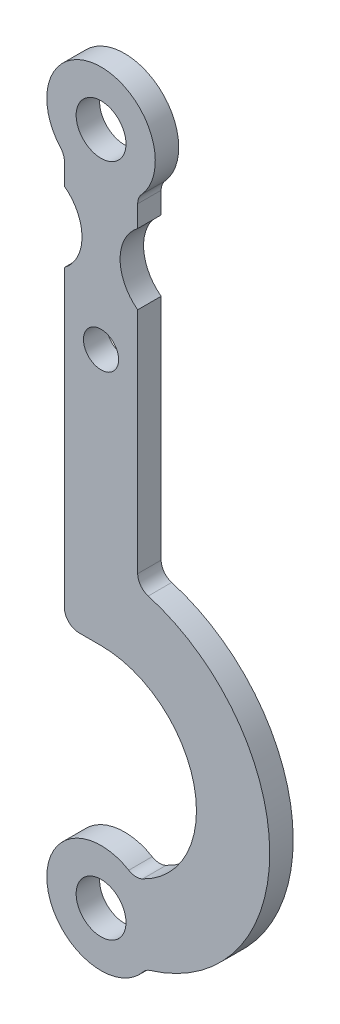
ISO-10303-21;
HEADER;
FILE_DESCRIPTION(('STEP AP214'),'2;1');
FILE_NAME('part.step','',(''),(''),'','','');
FILE_SCHEMA(('AUTOMOTIVE_DESIGN { 1 0 10303 214 1 1 1 1 }'));
ENDSEC;
DATA;
#1=APPLICATION_CONTEXT('core data for automotive mechanical design processes');
#2=APPLICATION_PROTOCOL_DEFINITION('international standard','automotive_design',2000,#1);
#3=PRODUCT_CONTEXT('',#1,'mechanical');
#4=PRODUCT('Part','Part','',(#3));
#5=PRODUCT_RELATED_PRODUCT_CATEGORY('part','',(#4));
#6=PRODUCT_DEFINITION_FORMATION('','',#4);
#7=PRODUCT_DEFINITION_CONTEXT('part definition',#1,'design');
#8=PRODUCT_DEFINITION('design','',#6,#7);
#9=PRODUCT_DEFINITION_SHAPE('','',#8);
#10=(LENGTH_UNIT() NAMED_UNIT(*) SI_UNIT(.MILLI.,.METRE.));
#11=(NAMED_UNIT(*) PLANE_ANGLE_UNIT() SI_UNIT($,.RADIAN.));
#12=(NAMED_UNIT(*) SI_UNIT($,.STERADIAN.) SOLID_ANGLE_UNIT());
#13=UNCERTAINTY_MEASURE_WITH_UNIT(LENGTH_MEASURE(1.E-05),#10,'distance_accuracy_value','');
#14=(GEOMETRIC_REPRESENTATION_CONTEXT(3) GLOBAL_UNCERTAINTY_ASSIGNED_CONTEXT((#13)) GLOBAL_UNIT_ASSIGNED_CONTEXT((#10,
#11,#12)) REPRESENTATION_CONTEXT('',''));
#15=CARTESIAN_POINT('',(0.,0.,0.));
#16=DIRECTION('',(0.,0.,1.));
#17=DIRECTION('',(1.,0.,0.));
#18=AXIS2_PLACEMENT_3D('',#15,#16,#17);
#19=CARTESIAN_POINT('',(0.,-230.,8.));
#20=DIRECTION('',(0.,0.,-1.));
#21=DIRECTION('',(-1.,0.,0.));
#22=AXIS2_PLACEMENT_3D('',#19,#20,#21);
#23=CYLINDRICAL_SURFACE('',#22,18.5);
#24=CARTESIAN_POINT('',(0.,-230.,0.));
#25=DIRECTION('',(0.,0.,1.));
#26=DIRECTION('',(1.,0.,0.));
#27=AXIS2_PLACEMENT_3D('',#24,#25,#26);
#28=CIRCLE('',#27,18.5);
#29=CARTESIAN_POINT('',(9.44463891587366,-214.092492472145,0.));
#30=VERTEX_POINT('',#29);
#31=CARTESIAN_POINT('',(14.3530284553606,-241.672213764304,0.));
#32=VERTEX_POINT('',#31);
#33=EDGE_CURVE('E224',#30,#32,#28,.T.);
#34=ORIENTED_EDGE('',*,*,#33,.T.);
#35=DIRECTION('',(0.,0.,-1.));
#36=VECTOR('',#35,1.);
#37=CARTESIAN_POINT('',(14.3530284553606,-241.672213764304,8.));
#38=LINE('',#37,#36);
#39=CARTESIAN_POINT('',(14.3530284553606,-241.672213764304,8.));
#40=VERTEX_POINT('',#39);
#41=EDGE_CURVE('E265',#32,#40,#38,.F.);
#42=ORIENTED_EDGE('',*,*,#41,.T.);
#43=CARTESIAN_POINT('',(0.,-230.,8.));
#44=DIRECTION('',(0.,0.,1.));
#45=DIRECTION('',(1.,0.,0.));
#46=AXIS2_PLACEMENT_3D('',#43,#44,#45);
#47=CIRCLE('',#46,18.5);
#48=CARTESIAN_POINT('',(9.44463891587366,-214.092492472145,8.));
#49=VERTEX_POINT('',#48);
#50=EDGE_CURVE('E391',#49,#40,#47,.T.);
#51=ORIENTED_EDGE('',*,*,#50,.F.);
#52=DIRECTION('',(0.,0.,-1.));
#53=VECTOR('',#52,1.);
#54=CARTESIAN_POINT('',(9.44463891587366,-214.092492472145,8.));
#55=LINE('',#54,#53);
#56=EDGE_CURVE('E262',#49,#30,#55,.T.);
#57=ORIENTED_EDGE('',*,*,#56,.T.);
#58=EDGE_LOOP('',(#34,#42,#51,#57));
#59=FACE_BOUND('',#58,.T.);
#60=ADVANCED_FACE('F47',(#59),#23,.T.);
#61=CARTESIAN_POINT('',(0.,-185.,8.));
#62=DIRECTION('',(0.,0.,-1.));
#63=DIRECTION('',(-1.,0.,0.));
#64=AXIS2_PLACEMENT_3D('',#61,#62,#63);
#65=CYLINDRICAL_SURFACE('',#64,57.5433285968466);
#66=CARTESIAN_POINT('',(0.,-185.,8.));
#67=DIRECTION('',(0.,0.,1.));
#68=DIRECTION('',(1.,0.,0.));
#69=AXIS2_PLACEMENT_3D('',#66,#67,#68);
#70=CIRCLE('',#69,57.5433285968466);
#71=CARTESIAN_POINT('',(16.7746577780857,-240.044032577862,8.));
#72=VERTEX_POINT('',#71);
#73=CARTESIAN_POINT('',(16.1009698881871,-129.755150152577,8.));
#74=VERTEX_POINT('',#73);
#75=EDGE_CURVE('E189',#72,#74,#70,.T.);
#76=ORIENTED_EDGE('',*,*,#75,.F.);
#77=DIRECTION('',(0.,0.,-1.));
#78=VECTOR('',#77,1.);
#79=CARTESIAN_POINT('',(16.7746577780857,-240.044032577862,8.));
#80=LINE('',#79,#78);
#81=CARTESIAN_POINT('',(16.7746577780857,-240.044032577862,0.));
#82=VERTEX_POINT('',#81);
#83=EDGE_CURVE('E259',#72,#82,#80,.T.);
#84=ORIENTED_EDGE('',*,*,#83,.T.);
#85=CARTESIAN_POINT('',(0.,-185.,0.));
#86=DIRECTION('',(0.,0.,1.));
#87=DIRECTION('',(1.,0.,0.));
#88=AXIS2_PLACEMENT_3D('',#85,#86,#87);
#89=CIRCLE('',#88,57.5433285968466);
#90=CARTESIAN_POINT('',(16.1009698881871,-129.755150152577,0.));
#91=VERTEX_POINT('',#90);
#92=EDGE_CURVE('E227',#82,#91,#89,.T.);
#93=ORIENTED_EDGE('',*,*,#92,.T.);
#94=DIRECTION('',(0.,0.,-1.));
#95=VECTOR('',#94,1.);
#96=CARTESIAN_POINT('',(16.1009698881871,-129.755150152577,8.));
#97=LINE('',#96,#95);
#98=EDGE_CURVE('E179',#91,#74,#97,.F.);
#99=ORIENTED_EDGE('',*,*,#98,.T.);
#100=EDGE_LOOP('',(#76,#84,#93,#99));
#101=FACE_BOUND('',#100,.T.);
#102=ADVANCED_FACE('F309',(#101),#65,.T.);
#103=CARTESIAN_POINT('',(12.5,0.,8.));
#104=DIRECTION('',(1.,0.,0.));
#105=DIRECTION('',(0.,1.,0.));
#106=AXIS2_PLACEMENT_3D('',#103,#104,#105);
#107=PLANE('',#106);
#108=DIRECTION('',(0.,-1.,0.));
#109=VECTOR('',#108,1.);
#110=CARTESIAN_POINT('',(12.5,0.,8.));
#111=LINE('',#110,#109);
#112=CARTESIAN_POINT('',(12.5,-47.,8.));
#113=VERTEX_POINT('',#112);
#114=CARTESIAN_POINT('',(12.5,-124.954867374839,8.));
#115=VERTEX_POINT('',#114);
#116=EDGE_CURVE('E171',#113,#115,#111,.T.);
#117=ORIENTED_EDGE('',*,*,#116,.T.);
#118=DIRECTION('',(0.,0.,-1.));
#119=VECTOR('',#118,1.);
#120=CARTESIAN_POINT('',(12.5,-124.954867374839,8.));
#121=LINE('',#120,#119);
#122=CARTESIAN_POINT('',(12.5,-124.954867374839,0.));
#123=VERTEX_POINT('',#122);
#124=EDGE_CURVE('E279',#115,#123,#121,.T.);
#125=ORIENTED_EDGE('',*,*,#124,.T.);
#126=DIRECTION('',(0.,-1.,0.));
#127=VECTOR('',#126,1.);
#128=CARTESIAN_POINT('',(12.5,0.,0.));
#129=LINE('',#128,#127);
#130=CARTESIAN_POINT('',(12.5,-47.,0.));
#131=VERTEX_POINT('',#130);
#132=EDGE_CURVE('E174',#131,#123,#129,.T.);
#133=ORIENTED_EDGE('',*,*,#132,.F.);
#134=DIRECTION('',(0.,0.,-1.));
#135=VECTOR('',#134,1.);
#136=CARTESIAN_POINT('',(12.5,-47.,8.));
#137=LINE('',#136,#135);
#138=EDGE_CURVE('E167',#113,#131,#137,.T.);
#139=ORIENTED_EDGE('',*,*,#138,.F.);
#140=EDGE_LOOP('',(#117,#125,#133,#139));
#141=FACE_BOUND('',#140,.T.);
#142=ADVANCED_FACE('F169',(#141),#107,.T.);
#143=CARTESIAN_POINT('',(21.5,-35.,8.));
#144=DIRECTION('',(0.,0.,-1.));
#145=DIRECTION('',(-1.,0.,0.));
#146=AXIS2_PLACEMENT_3D('',#143,#144,#145);
#147=CYLINDRICAL_SURFACE('',#146,15.);
#148=CARTESIAN_POINT('',(21.5,-35.,0.));
#149=DIRECTION('',(0.,0.,1.));
#150=DIRECTION('',(1.,0.,0.));
#151=AXIS2_PLACEMENT_3D('',#148,#149,#150);
#152=CIRCLE('',#151,15.);
#153=CARTESIAN_POINT('',(12.5,-23.,0.));
#154=VERTEX_POINT('',#153);
#155=EDGE_CURVE('E231',#154,#131,#152,.T.);
#156=ORIENTED_EDGE('',*,*,#155,.F.);
#157=DIRECTION('',(0.,0.,-1.));
#158=VECTOR('',#157,1.);
#159=CARTESIAN_POINT('',(12.5,-23.,8.));
#160=LINE('',#159,#158);
#161=CARTESIAN_POINT('',(12.5,-23.,8.));
#162=VERTEX_POINT('',#161);
#163=EDGE_CURVE('E180',#162,#154,#160,.T.);
#164=ORIENTED_EDGE('',*,*,#163,.F.);
#165=CARTESIAN_POINT('',(21.5,-35.,8.));
#166=DIRECTION('',(0.,0.,1.));
#167=DIRECTION('',(1.,0.,0.));
#168=AXIS2_PLACEMENT_3D('',#165,#166,#167);
#169=CIRCLE('',#168,15.);
#170=EDGE_CURVE('E186',#162,#113,#169,.T.);
#171=ORIENTED_EDGE('',*,*,#170,.T.);
#172=ORIENTED_EDGE('',*,*,#138,.T.);
#173=EDGE_LOOP('',(#156,#164,#171,#172));
#174=FACE_BOUND('',#173,.T.);
#175=ADVANCED_FACE('F192',(#174),#147,.F.);
#176=CARTESIAN_POINT('',(12.5,0.,8.));
#177=DIRECTION('',(1.,0.,0.));
#178=DIRECTION('',(0.,1.,0.));
#179=AXIS2_PLACEMENT_3D('',#176,#177,#178);
#180=PLANE('',#179);
#181=DIRECTION('',(0.,-1.,0.));
#182=VECTOR('',#181,1.);
#183=CARTESIAN_POINT('',(12.5,0.,0.));
#184=LINE('',#183,#182);
#185=CARTESIAN_POINT('',(12.5,-15.6843871413581,0.));
#186=VERTEX_POINT('',#185);
#187=EDGE_CURVE('E233',#186,#154,#184,.T.);
#188=ORIENTED_EDGE('',*,*,#187,.F.);
#189=DIRECTION('',(0.,0.,1.));
#190=VECTOR('',#189,1.);
#191=CARTESIAN_POINT('',(12.5,-15.6843871413581,8.));
#192=LINE('',#191,#190);
#193=CARTESIAN_POINT('',(12.5,-15.6843871413581,8.));
#194=VERTEX_POINT('',#193);
#195=EDGE_CURVE('E274',#186,#194,#192,.T.);
#196=ORIENTED_EDGE('',*,*,#195,.T.);
#197=DIRECTION('',(0.,-1.,0.));
#198=VECTOR('',#197,1.);
#199=CARTESIAN_POINT('',(12.5,0.,8.));
#200=LINE('',#199,#198);
#201=EDGE_CURVE('E194',#194,#162,#200,.T.);
#202=ORIENTED_EDGE('',*,*,#201,.T.);
#203=ORIENTED_EDGE('',*,*,#163,.T.);
#204=EDGE_LOOP('',(#188,#196,#202,#203));
#205=FACE_BOUND('',#204,.T.);
#206=ADVANCED_FACE('F434',(#205),#180,.T.);
#207=CARTESIAN_POINT('',(0.,0.,8.));
#208=DIRECTION('',(0.,0.,-1.));
#209=DIRECTION('',(-1.,0.,0.));
#210=AXIS2_PLACEMENT_3D('',#207,#208,#209);
#211=CYLINDRICAL_SURFACE('',#210,18.5);
#212=CARTESIAN_POINT('',(0.,0.,8.));
#213=DIRECTION('',(0.,0.,1.));
#214=DIRECTION('',(1.,0.,0.));
#215=AXIS2_PLACEMENT_3D('',#212,#213,#214);
#216=CIRCLE('',#215,18.5);
#217=CARTESIAN_POINT('',(-13.7765957446809,-12.3472834942607,8.));
#218=VERTEX_POINT('',#217);
#219=CARTESIAN_POINT('',(13.7765957446809,-12.3472834942607,8.));
#220=VERTEX_POINT('',#219);
#221=EDGE_CURVE('E196',#218,#220,#216,.F.);
#222=ORIENTED_EDGE('',*,*,#221,.T.);
#223=DIRECTION('',(0.,0.,-1.));
#224=VECTOR('',#223,1.);
#225=CARTESIAN_POINT('',(13.7765957446809,-12.3472834942607,8.));
#226=LINE('',#225,#224);
#227=CARTESIAN_POINT('',(13.7765957446809,-12.3472834942607,0.));
#228=VERTEX_POINT('',#227);
#229=EDGE_CURVE('E271',#220,#228,#226,.T.);
#230=ORIENTED_EDGE('',*,*,#229,.T.);
#231=CARTESIAN_POINT('',(0.,0.,0.));
#232=DIRECTION('',(0.,0.,1.));
#233=DIRECTION('',(1.,0.,0.));
#234=AXIS2_PLACEMENT_3D('',#231,#232,#233);
#235=CIRCLE('',#234,18.5);
#236=CARTESIAN_POINT('',(-13.7765957446809,-12.3472834942607,0.));
#237=VERTEX_POINT('',#236);
#238=EDGE_CURVE('E235',#237,#228,#235,.F.);
#239=ORIENTED_EDGE('',*,*,#238,.F.);
#240=DIRECTION('',(0.,0.,-1.));
#241=VECTOR('',#240,1.);
#242=CARTESIAN_POINT('',(-13.7765957446809,-12.3472834942607,8.));
#243=LINE('',#242,#241);
#244=EDGE_CURVE('E269',#237,#218,#243,.F.);
#245=ORIENTED_EDGE('',*,*,#244,.T.);
#246=EDGE_LOOP('',(#222,#230,#239,#245));
#247=FACE_BOUND('',#246,.T.);
#248=ADVANCED_FACE('F363',(#247),#211,.T.);
#249=CARTESIAN_POINT('',(-12.5,0.,8.));
#250=DIRECTION('',(1.,0.,0.));
#251=DIRECTION('',(0.,1.,0.));
#252=AXIS2_PLACEMENT_3D('',#249,#250,#251);
#253=PLANE('',#252);
#254=DIRECTION('',(0.,-1.,0.));
#255=VECTOR('',#254,1.);
#256=CARTESIAN_POINT('',(-12.5,0.,8.));
#257=LINE('',#256,#255);
#258=CARTESIAN_POINT('',(-12.5,-15.6843871413581,8.));
#259=VERTEX_POINT('',#258);
#260=CARTESIAN_POINT('',(-12.5,-23.,8.));
#261=VERTEX_POINT('',#260);
#262=EDGE_CURVE('E202',#259,#261,#257,.T.);
#263=ORIENTED_EDGE('',*,*,#262,.F.);
#264=DIRECTION('',(0.,0.,-1.));
#265=VECTOR('',#264,1.);
#266=CARTESIAN_POINT('',(-12.5,-15.6843871413581,8.));
#267=LINE('',#266,#265);
#268=CARTESIAN_POINT('',(-12.5,-15.6843871413581,0.));
#269=VERTEX_POINT('',#268);
#270=EDGE_CURVE('E276',#259,#269,#267,.T.);
#271=ORIENTED_EDGE('',*,*,#270,.T.);
#272=DIRECTION('',(0.,-1.,0.));
#273=VECTOR('',#272,1.);
#274=CARTESIAN_POINT('',(-12.5,0.,0.));
#275=LINE('',#274,#273);
#276=CARTESIAN_POINT('',(-12.5,-23.,0.));
#277=VERTEX_POINT('',#276);
#278=EDGE_CURVE('E238',#269,#277,#275,.T.);
#279=ORIENTED_EDGE('',*,*,#278,.T.);
#280=DIRECTION('',(0.,0.,-1.));
#281=VECTOR('',#280,1.);
#282=CARTESIAN_POINT('',(-12.5,-23.,8.));
#283=LINE('',#282,#281);
#284=EDGE_CURVE('E254',#261,#277,#283,.T.);
#285=ORIENTED_EDGE('',*,*,#284,.F.);
#286=EDGE_LOOP('',(#263,#271,#279,#285));
#287=FACE_BOUND('',#286,.T.);
#288=ADVANCED_FACE('F370',(#287),#253,.F.);
#289=CARTESIAN_POINT('',(-21.5,-35.,8.));
#290=DIRECTION('',(0.,0.,-1.));
#291=DIRECTION('',(-1.,0.,0.));
#292=AXIS2_PLACEMENT_3D('',#289,#290,#291);
#293=CYLINDRICAL_SURFACE('',#292,15.);
#294=CARTESIAN_POINT('',(-21.5,-35.,0.));
#295=DIRECTION('',(0.,0.,1.));
#296=DIRECTION('',(1.,0.,0.));
#297=AXIS2_PLACEMENT_3D('',#294,#295,#296);
#298=CIRCLE('',#297,15.);
#299=CARTESIAN_POINT('',(-12.5,-47.,0.));
#300=VERTEX_POINT('',#299);
#301=EDGE_CURVE('E240',#277,#300,#298,.F.);
#302=ORIENTED_EDGE('',*,*,#301,.T.);
#303=DIRECTION('',(0.,0.,-1.));
#304=VECTOR('',#303,1.);
#305=CARTESIAN_POINT('',(-12.5,-47.,8.));
#306=LINE('',#305,#304);
#307=CARTESIAN_POINT('',(-12.5,-47.,8.));
#308=VERTEX_POINT('',#307);
#309=EDGE_CURVE('E251',#308,#300,#306,.T.);
#310=ORIENTED_EDGE('',*,*,#309,.F.);
#311=CARTESIAN_POINT('',(-21.5,-35.,8.));
#312=DIRECTION('',(0.,0.,1.));
#313=DIRECTION('',(1.,0.,0.));
#314=AXIS2_PLACEMENT_3D('',#311,#312,#313);
#315=CIRCLE('',#314,15.);
#316=EDGE_CURVE('E204',#261,#308,#315,.F.);
#317=ORIENTED_EDGE('',*,*,#316,.F.);
#318=ORIENTED_EDGE('',*,*,#284,.T.);
#319=EDGE_LOOP('',(#302,#310,#317,#318));
#320=FACE_BOUND('',#319,.T.);
#321=ADVANCED_FACE('F376',(#320),#293,.F.);
#322=CARTESIAN_POINT('',(-12.5,0.,8.));
#323=DIRECTION('',(1.,0.,0.));
#324=DIRECTION('',(0.,1.,0.));
#325=AXIS2_PLACEMENT_3D('',#322,#323,#324);
#326=PLANE('',#325);
#327=DIRECTION('',(0.,-1.,0.));
#328=VECTOR('',#327,1.);
#329=CARTESIAN_POINT('',(-12.5,0.,0.));
#330=LINE('',#329,#328);
#331=CARTESIAN_POINT('',(-12.5,-147.456671403153,0.));
#332=VERTEX_POINT('',#331);
#333=EDGE_CURVE('E242',#300,#332,#330,.T.);
#334=ORIENTED_EDGE('',*,*,#333,.T.);
#335=DIRECTION('',(0.,0.,-1.));
#336=VECTOR('',#335,1.);
#337=CARTESIAN_POINT('',(-12.5,-147.456671403153,8.));
#338=LINE('',#337,#336);
#339=CARTESIAN_POINT('',(-12.5,-147.456671403153,8.));
#340=VERTEX_POINT('',#339);
#341=EDGE_CURVE('E62',#332,#340,#338,.F.);
#342=ORIENTED_EDGE('',*,*,#341,.T.);
#343=DIRECTION('',(0.,-1.,0.));
#344=VECTOR('',#343,1.);
#345=CARTESIAN_POINT('',(-12.5,0.,8.));
#346=LINE('',#345,#344);
#347=EDGE_CURVE('E206',#308,#340,#346,.T.);
#348=ORIENTED_EDGE('',*,*,#347,.F.);
#349=ORIENTED_EDGE('',*,*,#309,.T.);
#350=EDGE_LOOP('',(#334,#342,#348,#349));
#351=FACE_BOUND('',#350,.T.);
#352=ADVANCED_FACE('F425',(#351),#326,.F.);
#353=CARTESIAN_POINT('',(0.,-152.456671403153,8.));
#354=DIRECTION('',(0.,-1.,0.));
#355=DIRECTION('',(0.,0.,-1.));
#356=AXIS2_PLACEMENT_3D('',#353,#354,#355);
#357=PLANE('',#356);
#358=DIRECTION('',(-1.,0.,0.));
#359=VECTOR('',#358,1.);
#360=CARTESIAN_POINT('',(0.,-152.456671403153,8.));
#361=LINE('',#360,#359);
#362=CARTESIAN_POINT('',(0.,-152.456671403153,8.));
#363=VERTEX_POINT('',#362);
#364=CARTESIAN_POINT('',(-7.49999999999999,-152.456671403153,8.));
#365=VERTEX_POINT('',#364);
#366=EDGE_CURVE('E208',#363,#365,#361,.T.);
#367=ORIENTED_EDGE('',*,*,#366,.T.);
#368=DIRECTION('',(0.,0.,-1.));
#369=VECTOR('',#368,1.);
#370=CARTESIAN_POINT('',(-7.49999999999999,-152.456671403153,0.));
#371=LINE('',#370,#369);
#372=CARTESIAN_POINT('',(-7.49999999999999,-152.456671403153,0.));
#373=VERTEX_POINT('',#372);
#374=EDGE_CURVE('E281',#365,#373,#371,.T.);
#375=ORIENTED_EDGE('',*,*,#374,.T.);
#376=DIRECTION('',(-1.,0.,0.));
#377=VECTOR('',#376,1.);
#378=CARTESIAN_POINT('',(0.,-152.456671403153,0.));
#379=LINE('',#378,#377);
#380=CARTESIAN_POINT('',(0.,-152.456671403153,0.));
#381=VERTEX_POINT('',#380);
#382=EDGE_CURVE('E244',#381,#373,#379,.T.);
#383=ORIENTED_EDGE('',*,*,#382,.F.);
#384=DIRECTION('',(0.,0.,-1.));
#385=VECTOR('',#384,1.);
#386=CARTESIAN_POINT('',(0.,-152.456671403153,8.));
#387=LINE('',#386,#385);
#388=EDGE_CURVE('E214',#363,#381,#387,.T.);
#389=ORIENTED_EDGE('',*,*,#388,.F.);
#390=EDGE_LOOP('',(#367,#375,#383,#389));
#391=FACE_BOUND('',#390,.T.);
#392=ADVANCED_FACE('F336',(#391),#357,.T.);
#393=CARTESIAN_POINT('',(0.,0.,8.));
#394=DIRECTION('',(0.,0.,-1.));
#395=DIRECTION('',(-1.,0.,0.));
#396=AXIS2_PLACEMENT_3D('',#393,#394,#395);
#397=CYLINDRICAL_SURFACE('',#396,8.5);
#398=CARTESIAN_POINT('',(0.,0.,8.));
#399=DIRECTION('',(0.,0.,1.));
#400=DIRECTION('',(1.,0.,0.));
#401=AXIS2_PLACEMENT_3D('',#398,#399,#400);
#402=CIRCLE('',#401,8.5);
#403=CARTESIAN_POINT('',(8.5,0.,8.));
#404=VERTEX_POINT('',#403);
#405=EDGE_CURVE('E394',#404,#404,#402,.T.);
#406=ORIENTED_EDGE('',*,*,#405,.T.);
#407=EDGE_LOOP('',(#406));
#408=FACE_BOUND('',#407,.T.);
#409=CARTESIAN_POINT('',(0.,0.,0.));
#410=DIRECTION('',(0.,0.,1.));
#411=DIRECTION('',(1.,0.,0.));
#412=AXIS2_PLACEMENT_3D('',#409,#410,#411);
#413=CIRCLE('',#412,8.5);
#414=CARTESIAN_POINT('',(8.5,0.,0.));
#415=VERTEX_POINT('',#414);
#416=EDGE_CURVE('E221',#415,#415,#413,.T.);
#417=ORIENTED_EDGE('',*,*,#416,.F.);
#418=EDGE_LOOP('',(#417));
#419=FACE_BOUND('',#418,.T.);
#420=ADVANCED_FACE('F332',(#408,#419),#397,.F.);
#421=CARTESIAN_POINT('',(0.,-230.,8.));
#422=DIRECTION('',(0.,0.,-1.));
#423=DIRECTION('',(-1.,0.,0.));
#424=AXIS2_PLACEMENT_3D('',#421,#422,#423);
#425=CYLINDRICAL_SURFACE('',#424,8.50000000000001);
#426=CARTESIAN_POINT('',(0.,-230.,8.));
#427=DIRECTION('',(0.,0.,1.));
#428=DIRECTION('',(1.,0.,0.));
#429=AXIS2_PLACEMENT_3D('',#426,#427,#428);
#430=CIRCLE('',#429,8.50000000000001);
#431=CARTESIAN_POINT('',(8.50000000000001,-230.,8.));
#432=VERTEX_POINT('',#431);
#433=EDGE_CURVE('E397',#432,#432,#430,.T.);
#434=ORIENTED_EDGE('',*,*,#433,.T.);
#435=EDGE_LOOP('',(#434));
#436=FACE_BOUND('',#435,.T.);
#437=CARTESIAN_POINT('',(0.,-230.,0.));
#438=DIRECTION('',(0.,0.,1.));
#439=DIRECTION('',(1.,0.,0.));
#440=AXIS2_PLACEMENT_3D('',#437,#438,#439);
#441=CIRCLE('',#440,8.50000000000001);
#442=CARTESIAN_POINT('',(8.50000000000001,-230.,0.));
#443=VERTEX_POINT('',#442);
#444=EDGE_CURVE('E218',#443,#443,#441,.T.);
#445=ORIENTED_EDGE('',*,*,#444,.F.);
#446=EDGE_LOOP('',(#445));
#447=FACE_BOUND('',#446,.T.);
#448=ADVANCED_FACE('F335',(#436,#447),#425,.F.);
#449=CARTESIAN_POINT('',(0.,-65.,8.));
#450=DIRECTION('',(0.,0.,-1.));
#451=DIRECTION('',(-1.,0.,0.));
#452=AXIS2_PLACEMENT_3D('',#449,#450,#451);
#453=CYLINDRICAL_SURFACE('',#452,6.);
#454=CARTESIAN_POINT('',(0.,-65.,8.));
#455=DIRECTION('',(0.,0.,1.));
#456=DIRECTION('',(1.,0.,0.));
#457=AXIS2_PLACEMENT_3D('',#454,#455,#456);
#458=CIRCLE('',#457,6.);
#459=CARTESIAN_POINT('',(6.,-65.,8.));
#460=VERTEX_POINT('',#459);
#461=EDGE_CURVE('E249',#460,#460,#458,.T.);
#462=ORIENTED_EDGE('',*,*,#461,.T.);
#463=EDGE_LOOP('',(#462));
#464=FACE_BOUND('',#463,.T.);
#465=CARTESIAN_POINT('',(0.,-65.,0.));
#466=DIRECTION('',(0.,0.,1.));
#467=DIRECTION('',(1.,0.,0.));
#468=AXIS2_PLACEMENT_3D('',#465,#466,#467);
#469=CIRCLE('',#468,6.);
#470=CARTESIAN_POINT('',(6.,-65.,0.));
#471=VERTEX_POINT('',#470);
#472=EDGE_CURVE('E215',#471,#471,#469,.T.);
#473=ORIENTED_EDGE('',*,*,#472,.F.);
#474=EDGE_LOOP('',(#473));
#475=FACE_BOUND('',#474,.T.);
#476=ADVANCED_FACE('F340',(#464,#475),#453,.F.);
#477=CARTESIAN_POINT('',(0.,-185.,8.));
#478=DIRECTION('',(0.,0.,-1.));
#479=DIRECTION('',(-1.,0.,0.));
#480=AXIS2_PLACEMENT_3D('',#477,#478,#479);
#481=CYLINDRICAL_SURFACE('',#480,32.5433285968467);
#482=CARTESIAN_POINT('',(0.,-185.,0.));
#483=DIRECTION('',(0.,0.,1.));
#484=DIRECTION('',(1.,0.,0.));
#485=AXIS2_PLACEMENT_3D('',#482,#483,#484);
#486=CIRCLE('',#485,32.5433285968467);
#487=CARTESIAN_POINT('',(14.1751296796172,-214.293923170657,0.));
#488=VERTEX_POINT('',#487);
#489=EDGE_CURVE('E246',#381,#488,#486,.F.);
#490=ORIENTED_EDGE('',*,*,#489,.T.);
#491=DIRECTION('',(0.,0.,-1.));
#492=VECTOR('',#491,1.);
#493=CARTESIAN_POINT('',(14.1751296796172,-214.293923170657,8.));
#494=LINE('',#493,#492);
#495=CARTESIAN_POINT('',(14.1751296796172,-214.293923170657,8.));
#496=VERTEX_POINT('',#495);
#497=EDGE_CURVE('E267',#488,#496,#494,.F.);
#498=ORIENTED_EDGE('',*,*,#497,.T.);
#499=CARTESIAN_POINT('',(0.,-185.,8.));
#500=DIRECTION('',(0.,0.,1.));
#501=DIRECTION('',(1.,0.,0.));
#502=AXIS2_PLACEMENT_3D('',#499,#500,#501);
#503=CIRCLE('',#502,32.5433285968467);
#504=EDGE_CURVE('E211',#363,#496,#503,.F.);
#505=ORIENTED_EDGE('',*,*,#504,.F.);
#506=ORIENTED_EDGE('',*,*,#388,.T.);
#507=EDGE_LOOP('',(#490,#498,#505,#506));
#508=FACE_BOUND('',#507,.T.);
#509=ADVANCED_FACE('F343',(#508),#481,.F.);
#510=CARTESIAN_POINT('',(0.,0.,8.));
#511=DIRECTION('',(0.,0.,1.));
#512=DIRECTION('',(1.,0.,0.));
#513=AXIS2_PLACEMENT_3D('',#510,#511,#512);
#514=PLANE('',#513);
#515=ORIENTED_EDGE('',*,*,#461,.F.);
#516=EDGE_LOOP('',(#515));
#517=FACE_BOUND('',#516,.T.);
#518=ORIENTED_EDGE('',*,*,#433,.F.);
#519=EDGE_LOOP('',(#518));
#520=FACE_BOUND('',#519,.T.);
#521=ORIENTED_EDGE('',*,*,#405,.F.);
#522=EDGE_LOOP('',(#521));
#523=FACE_BOUND('',#522,.T.);
#524=ORIENTED_EDGE('',*,*,#347,.T.);
#525=CARTESIAN_POINT('',(-7.49999999999999,-147.456671403153,8.));
#526=DIRECTION('',(0.,0.,1.));
#527=DIRECTION('',(1.,0.,0.));
#528=AXIS2_PLACEMENT_3D('',#525,#526,#527);
#529=CIRCLE('',#528,5.);
#530=EDGE_CURVE('E286',#340,#365,#529,.T.);
#531=ORIENTED_EDGE('',*,*,#530,.T.);
#532=ORIENTED_EDGE('',*,*,#366,.F.);
#533=ORIENTED_EDGE('',*,*,#504,.T.);
#534=CARTESIAN_POINT('',(11.997244028272,-209.793166113265,8.));
#535=DIRECTION('',(0.,0.,1.));
#536=DIRECTION('',(1.,0.,0.));
#537=AXIS2_PLACEMENT_3D('',#534,#535,#536);
#538=CIRCLE('',#537,5.);
#539=EDGE_CURVE('E294',#496,#49,#538,.F.);
#540=ORIENTED_EDGE('',*,*,#539,.T.);
#541=ORIENTED_EDGE('',*,*,#50,.T.);
#542=CARTESIAN_POINT('',(18.2322253351878,-244.826866133035,8.));
#543=DIRECTION('',(0.,0.,1.));
#544=DIRECTION('',(1.,0.,0.));
#545=AXIS2_PLACEMENT_3D('',#542,#543,#544);
#546=CIRCLE('',#545,5.);
#547=EDGE_CURVE('E290',#40,#72,#546,.F.);
#548=ORIENTED_EDGE('',*,*,#547,.T.);
#549=ORIENTED_EDGE('',*,*,#75,.T.);
#550=CARTESIAN_POINT('',(17.5,-124.954867374839,8.));
#551=DIRECTION('',(0.,0.,1.));
#552=DIRECTION('',(1.,0.,0.));
#553=AXIS2_PLACEMENT_3D('',#550,#551,#552);
#554=CIRCLE('',#553,5.);
#555=EDGE_CURVE('E11',#74,#115,#554,.F.);
#556=ORIENTED_EDGE('',*,*,#555,.T.);
#557=ORIENTED_EDGE('',*,*,#116,.F.);
#558=ORIENTED_EDGE('',*,*,#170,.F.);
#559=ORIENTED_EDGE('',*,*,#201,.F.);
#560=CARTESIAN_POINT('',(17.5,-15.6843871413581,8.));
#561=DIRECTION('',(0.,0.,1.));
#562=DIRECTION('',(1.,0.,0.));
#563=AXIS2_PLACEMENT_3D('',#560,#561,#562);
#564=CIRCLE('',#563,5.);
#565=EDGE_CURVE('E298',#194,#220,#564,.F.);
#566=ORIENTED_EDGE('',*,*,#565,.T.);
#567=ORIENTED_EDGE('',*,*,#221,.F.);
#568=CARTESIAN_POINT('',(-17.5,-15.6843871413581,8.));
#569=DIRECTION('',(0.,0.,1.));
#570=DIRECTION('',(1.,0.,0.));
#571=AXIS2_PLACEMENT_3D('',#568,#569,#570);
#572=CIRCLE('',#571,5.);
#573=EDGE_CURVE('E302',#218,#259,#572,.F.);
#574=ORIENTED_EDGE('',*,*,#573,.T.);
#575=ORIENTED_EDGE('',*,*,#262,.T.);
#576=ORIENTED_EDGE('',*,*,#316,.T.);
#577=EDGE_LOOP('',(#524,#531,#532,#533,#540,#541,#548,#549,#556,#557,#558,#559,#566,#567,#574,
#575,#576));
#578=FACE_BOUND('',#577,.T.);
#579=ADVANCED_FACE('F184',(#517,#520,#523,#578),#514,.T.);
#580=CARTESIAN_POINT('',(0.,0.,0.));
#581=DIRECTION('',(0.,0.,1.));
#582=DIRECTION('',(1.,0.,0.));
#583=AXIS2_PLACEMENT_3D('',#580,#581,#582);
#584=PLANE('',#583);
#585=ORIENTED_EDGE('',*,*,#472,.T.);
#586=EDGE_LOOP('',(#585));
#587=FACE_BOUND('',#586,.T.);
#588=ORIENTED_EDGE('',*,*,#444,.T.);
#589=EDGE_LOOP('',(#588));
#590=FACE_BOUND('',#589,.T.);
#591=ORIENTED_EDGE('',*,*,#416,.T.);
#592=EDGE_LOOP('',(#591));
#593=FACE_BOUND('',#592,.T.);
#594=ORIENTED_EDGE('',*,*,#382,.T.);
#595=CARTESIAN_POINT('',(-7.49999999999999,-147.456671403153,0.));
#596=DIRECTION('',(0.,0.,1.));
#597=DIRECTION('',(1.,0.,0.));
#598=AXIS2_PLACEMENT_3D('',#595,#596,#597);
#599=CIRCLE('',#598,5.);
#600=EDGE_CURVE('E70',#373,#332,#599,.F.);
#601=ORIENTED_EDGE('',*,*,#600,.T.);
#602=ORIENTED_EDGE('',*,*,#333,.F.);
#603=ORIENTED_EDGE('',*,*,#301,.F.);
#604=ORIENTED_EDGE('',*,*,#278,.F.);
#605=CARTESIAN_POINT('',(-17.5,-15.6843871413581,0.));
#606=DIRECTION('',(0.,0.,1.));
#607=DIRECTION('',(1.,0.,0.));
#608=AXIS2_PLACEMENT_3D('',#605,#606,#607);
#609=CIRCLE('',#608,5.);
#610=EDGE_CURVE('E300',#269,#237,#609,.T.);
#611=ORIENTED_EDGE('',*,*,#610,.T.);
#612=ORIENTED_EDGE('',*,*,#238,.T.);
#613=CARTESIAN_POINT('',(17.5,-15.6843871413581,0.));
#614=DIRECTION('',(0.,0.,1.));
#615=DIRECTION('',(1.,0.,0.));
#616=AXIS2_PLACEMENT_3D('',#613,#614,#615);
#617=CIRCLE('',#616,5.);
#618=EDGE_CURVE('E296',#228,#186,#617,.T.);
#619=ORIENTED_EDGE('',*,*,#618,.T.);
#620=ORIENTED_EDGE('',*,*,#187,.T.);
#621=ORIENTED_EDGE('',*,*,#155,.T.);
#622=ORIENTED_EDGE('',*,*,#132,.T.);
#623=CARTESIAN_POINT('',(17.5,-124.954867374839,0.));
#624=DIRECTION('',(0.,0.,1.));
#625=DIRECTION('',(1.,0.,0.));
#626=AXIS2_PLACEMENT_3D('',#623,#624,#625);
#627=CIRCLE('',#626,5.);
#628=EDGE_CURVE('E55',#123,#91,#627,.T.);
#629=ORIENTED_EDGE('',*,*,#628,.T.);
#630=ORIENTED_EDGE('',*,*,#92,.F.);
#631=CARTESIAN_POINT('',(18.2322253351878,-244.826866133035,0.));
#632=DIRECTION('',(0.,0.,1.));
#633=DIRECTION('',(1.,0.,0.));
#634=AXIS2_PLACEMENT_3D('',#631,#632,#633);
#635=CIRCLE('',#634,5.);
#636=EDGE_CURVE('E288',#82,#32,#635,.T.);
#637=ORIENTED_EDGE('',*,*,#636,.T.);
#638=ORIENTED_EDGE('',*,*,#33,.F.);
#639=CARTESIAN_POINT('',(11.997244028272,-209.793166113265,0.));
#640=DIRECTION('',(0.,0.,1.));
#641=DIRECTION('',(1.,0.,0.));
#642=AXIS2_PLACEMENT_3D('',#639,#640,#641);
#643=CIRCLE('',#642,5.);
#644=EDGE_CURVE('E292',#30,#488,#643,.T.);
#645=ORIENTED_EDGE('',*,*,#644,.T.);
#646=ORIENTED_EDGE('',*,*,#489,.F.);
#647=EDGE_LOOP('',(#594,#601,#602,#603,#604,#611,#612,#619,#620,#621,#622,#629,#630,#637,#638,
#645,#646));
#648=FACE_BOUND('',#647,.T.);
#649=ADVANCED_FACE('F304',(#587,#590,#593,#648),#584,.F.);
#650=CARTESIAN_POINT('',(18.2322253351878,-244.826866133035,8.));
#651=DIRECTION('',(0.,0.,1.));
#652=DIRECTION('',(1.,0.,0.));
#653=AXIS2_PLACEMENT_3D('',#650,#651,#652);
#654=CYLINDRICAL_SURFACE('',#653,5.);
#655=ORIENTED_EDGE('',*,*,#547,.F.);
#656=ORIENTED_EDGE('',*,*,#41,.F.);
#657=ORIENTED_EDGE('',*,*,#636,.F.);
#658=ORIENTED_EDGE('',*,*,#83,.F.);
#659=EDGE_LOOP('',(#655,#656,#657,#658));
#660=FACE_BOUND('',#659,.T.);
#661=ADVANCED_FACE('F345',(#660),#654,.F.);
#662=CARTESIAN_POINT('',(11.997244028272,-209.793166113265,8.));
#663=DIRECTION('',(0.,0.,-1.));
#664=DIRECTION('',(-1.,0.,0.));
#665=AXIS2_PLACEMENT_3D('',#662,#663,#664);
#666=CYLINDRICAL_SURFACE('',#665,5.);
#667=ORIENTED_EDGE('',*,*,#539,.F.);
#668=ORIENTED_EDGE('',*,*,#497,.F.);
#669=ORIENTED_EDGE('',*,*,#644,.F.);
#670=ORIENTED_EDGE('',*,*,#56,.F.);
#671=EDGE_LOOP('',(#667,#668,#669,#670));
#672=FACE_BOUND('',#671,.T.);
#673=ADVANCED_FACE('F348',(#672),#666,.F.);
#674=CARTESIAN_POINT('',(17.5,-15.6843871413581,8.));
#675=DIRECTION('',(0.,0.,-1.));
#676=DIRECTION('',(-1.,0.,0.));
#677=AXIS2_PLACEMENT_3D('',#674,#675,#676);
#678=CYLINDRICAL_SURFACE('',#677,5.);
#679=ORIENTED_EDGE('',*,*,#565,.F.);
#680=ORIENTED_EDGE('',*,*,#195,.F.);
#681=ORIENTED_EDGE('',*,*,#618,.F.);
#682=ORIENTED_EDGE('',*,*,#229,.F.);
#683=EDGE_LOOP('',(#679,#680,#681,#682));
#684=FACE_BOUND('',#683,.T.);
#685=ADVANCED_FACE('F319',(#684),#678,.F.);
#686=CARTESIAN_POINT('',(-17.5,-15.6843871413581,8.));
#687=DIRECTION('',(0.,0.,-1.));
#688=DIRECTION('',(-1.,0.,0.));
#689=AXIS2_PLACEMENT_3D('',#686,#687,#688);
#690=CYLINDRICAL_SURFACE('',#689,5.);
#691=ORIENTED_EDGE('',*,*,#573,.F.);
#692=ORIENTED_EDGE('',*,*,#244,.F.);
#693=ORIENTED_EDGE('',*,*,#610,.F.);
#694=ORIENTED_EDGE('',*,*,#270,.F.);
#695=EDGE_LOOP('',(#691,#692,#693,#694));
#696=FACE_BOUND('',#695,.T.);
#697=ADVANCED_FACE('F313',(#696),#690,.F.);
#698=CARTESIAN_POINT('',(17.5,-124.954867374839,8.));
#699=DIRECTION('',(0.,0.,-1.));
#700=DIRECTION('',(-1.,0.,0.));
#701=AXIS2_PLACEMENT_3D('',#698,#699,#700);
#702=CYLINDRICAL_SURFACE('',#701,5.);
#703=ORIENTED_EDGE('',*,*,#555,.F.);
#704=ORIENTED_EDGE('',*,*,#98,.F.);
#705=ORIENTED_EDGE('',*,*,#628,.F.);
#706=ORIENTED_EDGE('',*,*,#124,.F.);
#707=EDGE_LOOP('',(#703,#704,#705,#706));
#708=FACE_BOUND('',#707,.T.);
#709=ADVANCED_FACE('F311',(#708),#702,.F.);
#710=CARTESIAN_POINT('',(-7.49999999999999,-147.456671403153,8.));
#711=DIRECTION('',(0.,0.,1.));
#712=DIRECTION('',(1.,0.,0.));
#713=AXIS2_PLACEMENT_3D('',#710,#711,#712);
#714=CYLINDRICAL_SURFACE('',#713,5.);
#715=ORIENTED_EDGE('',*,*,#530,.F.);
#716=ORIENTED_EDGE('',*,*,#341,.F.);
#717=ORIENTED_EDGE('',*,*,#600,.F.);
#718=ORIENTED_EDGE('',*,*,#374,.F.);
#719=EDGE_LOOP('',(#715,#716,#717,#718));
#720=FACE_BOUND('',#719,.T.);
#721=ADVANCED_FACE('F49',(#720),#714,.T.);
#722=CLOSED_SHELL('',(#60,#102,#142,#175,#206,#248,#288,#321,#352,#392,#420,#448,#476,#509,#579,
#649,#661,#673,#685,#697,#709,#721));
#723=MANIFOLD_SOLID_BREP('B2',#722);
#724=ADVANCED_BREP_SHAPE_REPRESENTATION('',(#18,#723),#14);
#725=SHAPE_DEFINITION_REPRESENTATION(#9,#724);
ENDSEC;
END-ISO-10303-21;
